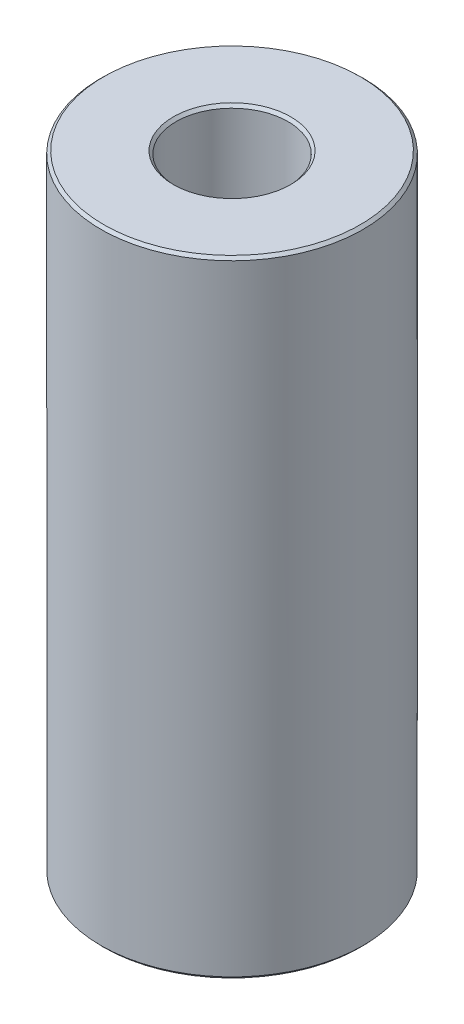
ISO-10303-21;
HEADER;
FILE_DESCRIPTION(('STEP AP214'),'2;1');
FILE_NAME('part.step','',(''),(''),'','','');
FILE_SCHEMA(('AUTOMOTIVE_DESIGN { 1 0 10303 214 1 1 1 1 }'));
ENDSEC;
DATA;
#1=APPLICATION_CONTEXT('core data for automotive mechanical design processes');
#2=APPLICATION_PROTOCOL_DEFINITION('international standard','automotive_design',2000,#1);
#3=PRODUCT_CONTEXT('',#1,'mechanical');
#4=PRODUCT('Part','Part','',(#3));
#5=PRODUCT_RELATED_PRODUCT_CATEGORY('part','',(#4));
#6=PRODUCT_DEFINITION_FORMATION('','',#4);
#7=PRODUCT_DEFINITION_CONTEXT('part definition',#1,'design');
#8=PRODUCT_DEFINITION('design','',#6,#7);
#9=PRODUCT_DEFINITION_SHAPE('','',#8);
#10=(LENGTH_UNIT() NAMED_UNIT(*) SI_UNIT(.MILLI.,.METRE.));
#11=(NAMED_UNIT(*) PLANE_ANGLE_UNIT() SI_UNIT($,.RADIAN.));
#12=(NAMED_UNIT(*) SI_UNIT($,.STERADIAN.) SOLID_ANGLE_UNIT());
#13=UNCERTAINTY_MEASURE_WITH_UNIT(LENGTH_MEASURE(1.E-05),#10,'distance_accuracy_value','');
#14=(GEOMETRIC_REPRESENTATION_CONTEXT(3) GLOBAL_UNCERTAINTY_ASSIGNED_CONTEXT((#13)) GLOBAL_UNIT_ASSIGNED_CONTEXT((#10,
#11,#12)) REPRESENTATION_CONTEXT('',''));
#15=CARTESIAN_POINT('',(0.,0.,0.));
#16=DIRECTION('',(0.,0.,1.));
#17=DIRECTION('',(1.,0.,0.));
#18=AXIS2_PLACEMENT_3D('',#15,#16,#17);
#19=CARTESIAN_POINT('',(0.,286.398965544174,0.));
#20=DIRECTION('',(0.,-1.,0.));
#21=DIRECTION('',(0.,0.,-1.));
#22=AXIS2_PLACEMENT_3D('',#19,#20,#21);
#23=CYLINDRICAL_SURFACE('',#22,60.);
#24=CARTESIAN_POINT('',(0.,1.29703923472141,0.));
#25=DIRECTION('',(0.,1.,0.));
#26=DIRECTION('',(0.,0.,1.));
#27=AXIS2_PLACEMENT_3D('',#24,#25,#26);
#28=CIRCLE('',#27,60.);
#29=CARTESIAN_POINT('',(0.,1.29703923472141,60.));
#30=VERTEX_POINT('',#29);
#31=EDGE_CURVE('E10',#30,#30,#28,.T.);
#32=ORIENTED_EDGE('',*,*,#31,.T.);
#33=EDGE_LOOP('',(#32));
#34=FACE_BOUND('',#33,.T.);
#35=CARTESIAN_POINT('',(0.,285.176597851393,0.));
#36=DIRECTION('',(0.,1.,0.));
#37=DIRECTION('',(0.,0.,1.));
#38=AXIS2_PLACEMENT_3D('',#35,#36,#37);
#39=CIRCLE('',#38,60.);
#40=CARTESIAN_POINT('',(0.,285.176597851393,-60.));
#41=VERTEX_POINT('',#40);
#42=EDGE_CURVE('E50',#41,#41,#39,.F.);
#43=ORIENTED_EDGE('',*,*,#42,.T.);
#44=EDGE_LOOP('',(#43));
#45=FACE_BOUND('',#44,.T.);
#46=ADVANCED_FACE('F39',(#34,#45),#23,.T.);
#47=CARTESIAN_POINT('',(0.,286.398965544174,0.));
#48=DIRECTION('',(0.,1.,0.));
#49=DIRECTION('',(0.,0.,1.));
#50=AXIS2_PLACEMENT_3D('',#47,#48,#49);
#51=PLANE('',#50);
#52=CARTESIAN_POINT('',(0.,286.398965544174,0.));
#53=DIRECTION('',(0.,1.,0.));
#54=DIRECTION('',(0.,0.,1.));
#55=AXIS2_PLACEMENT_3D('',#52,#53,#54);
#56=CIRCLE('',#55,26.880181913489);
#57=CARTESIAN_POINT('',(0.,286.398965544174,26.880181913489));
#58=VERTEX_POINT('',#57);
#59=EDGE_CURVE('E58',#58,#58,#56,.F.);
#60=ORIENTED_EDGE('',*,*,#59,.T.);
#61=EDGE_LOOP('',(#60));
#62=FACE_BOUND('',#61,.T.);
#63=CARTESIAN_POINT('',(0.,286.398965544174,0.));
#64=DIRECTION('',(0.,1.,0.));
#65=DIRECTION('',(0.,0.,1.));
#66=AXIS2_PLACEMENT_3D('',#63,#64,#65);
#67=CIRCLE('',#66,58.7029607652786);
#68=CARTESIAN_POINT('',(0.,286.398965544174,-58.7029607652787));
#69=VERTEX_POINT('',#68);
#70=EDGE_CURVE('E61',#69,#69,#67,.T.);
#71=ORIENTED_EDGE('',*,*,#70,.T.);
#72=EDGE_LOOP('',(#71));
#73=FACE_BOUND('',#72,.T.);
#74=ADVANCED_FACE('F88',(#62,#73),#51,.T.);
#75=CARTESIAN_POINT('',(0.,0.,0.));
#76=DIRECTION('',(0.,1.,0.));
#77=DIRECTION('',(0.,0.,1.));
#78=AXIS2_PLACEMENT_3D('',#75,#76,#77);
#79=PLANE('',#78);
#80=CARTESIAN_POINT('',(0.,0.,0.));
#81=DIRECTION('',(0.,1.,0.));
#82=DIRECTION('',(0.,0.,1.));
#83=AXIS2_PLACEMENT_3D('',#80,#81,#82);
#84=CIRCLE('',#83,26.9548534554291);
#85=CARTESIAN_POINT('',(0.,0.,26.9548534554291));
#86=VERTEX_POINT('',#85);
#87=EDGE_CURVE('E51',#86,#86,#84,.T.);
#88=ORIENTED_EDGE('',*,*,#87,.T.);
#89=EDGE_LOOP('',(#88));
#90=FACE_BOUND('',#89,.T.);
#91=CARTESIAN_POINT('',(0.,0.,0.));
#92=DIRECTION('',(0.,1.,0.));
#93=DIRECTION('',(0.,0.,1.));
#94=AXIS2_PLACEMENT_3D('',#91,#92,#93);
#95=CIRCLE('',#94,58.7776323072187);
#96=CARTESIAN_POINT('',(0.,0.,58.7776323072187));
#97=VERTEX_POINT('',#96);
#98=EDGE_CURVE('E54',#97,#97,#95,.F.);
#99=ORIENTED_EDGE('',*,*,#98,.T.);
#100=EDGE_LOOP('',(#99));
#101=FACE_BOUND('',#100,.T.);
#102=ADVANCED_FACE('F83',(#90,#101),#79,.F.);
#103=CARTESIAN_POINT('',(0.,286.398965544174,0.));
#104=DIRECTION('',(0.,-1.,0.));
#105=DIRECTION('',(0.,0.,-1.));
#106=AXIS2_PLACEMENT_3D('',#103,#104,#105);
#107=CYLINDRICAL_SURFACE('',#106,25.6578142207078);
#108=CARTESIAN_POINT('',(0.,285.101926309453,0.));
#109=DIRECTION('',(0.,1.,0.));
#110=DIRECTION('',(0.,0.,1.));
#111=AXIS2_PLACEMENT_3D('',#108,#109,#110);
#112=CIRCLE('',#111,25.6578142207078);
#113=CARTESIAN_POINT('',(0.,285.101926309453,25.6578142207078));
#114=VERTEX_POINT('',#113);
#115=EDGE_CURVE('E67',#114,#114,#112,.T.);
#116=ORIENTED_EDGE('',*,*,#115,.T.);
#117=EDGE_LOOP('',(#116));
#118=FACE_BOUND('',#117,.T.);
#119=CARTESIAN_POINT('',(0.,1.22236769278128,0.));
#120=DIRECTION('',(0.,1.,0.));
#121=DIRECTION('',(0.,0.,1.));
#122=AXIS2_PLACEMENT_3D('',#119,#120,#121);
#123=CIRCLE('',#122,25.6578142207078);
#124=CARTESIAN_POINT('',(0.,1.22236769278128,25.6578142207078));
#125=VERTEX_POINT('',#124);
#126=EDGE_CURVE('E69',#125,#125,#123,.F.);
#127=ORIENTED_EDGE('',*,*,#126,.T.);
#128=EDGE_LOOP('',(#127));
#129=FACE_BOUND('',#128,.T.);
#130=ADVANCED_FACE('F71',(#118,#129),#107,.F.);
#131=CARTESIAN_POINT('',(0.,285.101926309453,0.));
#132=DIRECTION('',(0.,1.,0.));
#133=DIRECTION('',(0.,0.,1.));
#134=AXIS2_PLACEMENT_3D('',#131,#132,#133);
#135=CONICAL_SURFACE('',#134,25.6578142207078,0.755768297835149);
#136=ORIENTED_EDGE('',*,*,#59,.F.);
#137=EDGE_LOOP('',(#136));
#138=FACE_BOUND('',#137,.T.);
#139=ORIENTED_EDGE('',*,*,#115,.F.);
#140=EDGE_LOOP('',(#139));
#141=FACE_BOUND('',#140,.T.);
#142=ADVANCED_FACE('F77',(#138,#141),#135,.F.);
#143=CARTESIAN_POINT('',(0.,0.,0.));
#144=DIRECTION('',(0.,-1.,0.));
#145=DIRECTION('',(0.,0.,-1.));
#146=AXIS2_PLACEMENT_3D('',#143,#144,#145);
#147=CONICAL_SURFACE('',#146,26.9548534554291,0.815028028959741);
#148=ORIENTED_EDGE('',*,*,#126,.F.);
#149=EDGE_LOOP('',(#148));
#150=FACE_BOUND('',#149,.T.);
#151=ORIENTED_EDGE('',*,*,#87,.F.);
#152=EDGE_LOOP('',(#151));
#153=FACE_BOUND('',#152,.T.);
#154=ADVANCED_FACE('F73',(#150,#153),#147,.F.);
#155=CARTESIAN_POINT('',(0.,1.29703923472141,0.));
#156=DIRECTION('',(0.,1.,0.));
#157=DIRECTION('',(0.,0.,1.));
#158=AXIS2_PLACEMENT_3D('',#155,#156,#157);
#159=CONICAL_SURFACE('',#158,60.,0.755768297835158);
#160=ORIENTED_EDGE('',*,*,#98,.F.);
#161=EDGE_LOOP('',(#160));
#162=FACE_BOUND('',#161,.T.);
#163=ORIENTED_EDGE('',*,*,#31,.F.);
#164=EDGE_LOOP('',(#163));
#165=FACE_BOUND('',#164,.T.);
#166=ADVANCED_FACE('F76',(#162,#165),#159,.T.);
#167=CARTESIAN_POINT('',(0.,286.398965544174,0.));
#168=DIRECTION('',(0.,-1.,0.));
#169=DIRECTION('',(0.,0.,-1.));
#170=AXIS2_PLACEMENT_3D('',#167,#168,#169);
#171=CONICAL_SURFACE('',#170,58.7029607652786,0.815028028959762);
#172=CARTESIAN_POINT('',(0.,285.176597851393,-60.));
#173=CARTESIAN_POINT('',(0.,285.189330848193,-59.9864891746383));
#174=CARTESIAN_POINT('',(0.,285.202063844993,-59.9729783492767));
#175=CARTESIAN_POINT('',(0.,285.227529838592,-59.9459566985533));
#176=CARTESIAN_POINT('',(0.,285.240262835392,-59.9324458731916));
#177=CARTESIAN_POINT('',(0.,285.265728828992,-59.9054242224683));
#178=CARTESIAN_POINT('',(0.,285.278461825791,-59.8919133971066));
#179=CARTESIAN_POINT('',(0.,285.303927819391,-59.8648917463832));
#180=CARTESIAN_POINT('',(0.,285.316660816191,-59.8513809210215));
#181=CARTESIAN_POINT('',(0.,285.34212680979,-59.8243592702982));
#182=CARTESIAN_POINT('',(0.,285.35485980659,-59.8108484449365));
#183=CARTESIAN_POINT('',(0.,285.38032580019,-59.7838267942131));
#184=CARTESIAN_POINT('',(0.,285.39305879699,-59.7703159688515));
#185=CARTESIAN_POINT('',(0.,285.418524790589,-59.7432943181281));
#186=CARTESIAN_POINT('',(0.,285.431257787389,-59.7297834927664));
#187=CARTESIAN_POINT('',(0.,285.456723780989,-59.702761842043));
#188=CARTESIAN_POINT('',(0.,285.469456777788,-59.6892510166814));
#189=CARTESIAN_POINT('',(0.,285.494922771388,-59.662229365958));
#190=CARTESIAN_POINT('',(0.,285.507655768188,-59.6487185405963));
#191=CARTESIAN_POINT('',(0.,285.533121761788,-59.621696889873));
#192=CARTESIAN_POINT('',(0.,285.545854758587,-59.6081860645113));
#193=CARTESIAN_POINT('',(0.,285.571320752187,-59.5811644137879));
#194=CARTESIAN_POINT('',(0.,285.584053748987,-59.5676535884262));
#195=CARTESIAN_POINT('',(0.,285.609519742586,-59.5406319377029));
#196=CARTESIAN_POINT('',(0.,285.622252739386,-59.5271211123412));
#197=CARTESIAN_POINT('',(0.,285.647718732986,-59.5000994616178));
#198=CARTESIAN_POINT('',(0.,285.660451729786,-59.4865886362562));
#199=CARTESIAN_POINT('',(0.,285.685917723385,-59.4595669855328));
#200=CARTESIAN_POINT('',(0.,285.698650720185,-59.4460561601711));
#201=CARTESIAN_POINT('',(0.,285.724116713785,-59.4190345094477));
#202=CARTESIAN_POINT('',(0.,285.736849710584,-59.4055236840861));
#203=CARTESIAN_POINT('',(0.,285.762315704184,-59.3785020333627));
#204=CARTESIAN_POINT('',(0.,285.775048700984,-59.364991208001));
#205=CARTESIAN_POINT('',(0.,285.800514694583,-59.3379695572777));
#206=CARTESIAN_POINT('',(0.,285.813247691383,-59.324458731916));
#207=CARTESIAN_POINT('',(0.,285.838713684983,-59.2974370811926));
#208=CARTESIAN_POINT('',(0.,285.851446681783,-59.2839262558309));
#209=CARTESIAN_POINT('',(0.,285.876912675382,-59.2569046051076));
#210=CARTESIAN_POINT('',(0.,285.889645672182,-59.2433937797459));
#211=CARTESIAN_POINT('',(0.,285.915111665782,-59.2163721290225));
#212=CARTESIAN_POINT('',(0.,285.927844662581,-59.2028613036609));
#213=CARTESIAN_POINT('',(0.,285.953310656181,-59.1758396529375));
#214=CARTESIAN_POINT('',(0.,285.966043652981,-59.1623288275758));
#215=CARTESIAN_POINT('',(0.,285.99150964658,-59.1353071768525));
#216=CARTESIAN_POINT('',(0.,286.00424264338,-59.1217963514908));
#217=CARTESIAN_POINT('',(0.,286.02970863698,-59.0947747007674));
#218=CARTESIAN_POINT('',(0.,286.04244163378,-59.0812638754057));
#219=CARTESIAN_POINT('',(0.,286.067907627379,-59.0542422246824));
#220=CARTESIAN_POINT('',(0.,286.080640624179,-59.0407313993207));
#221=CARTESIAN_POINT('',(0.,286.106106617779,-59.0137097485973));
#222=CARTESIAN_POINT('',(0.,286.118839614578,-59.0001989232357));
#223=CARTESIAN_POINT('',(0.,286.144305608178,-58.9731772725123));
#224=CARTESIAN_POINT('',(0.,286.157038604978,-58.9596664471506));
#225=CARTESIAN_POINT('',(0.,286.182504598578,-58.9326447964272));
#226=CARTESIAN_POINT('',(0.,286.195237595377,-58.9191339710656));
#227=CARTESIAN_POINT('',(0.,286.220703588977,-58.8921123203422));
#228=CARTESIAN_POINT('',(0.,286.233436585777,-58.8786014949805));
#229=CARTESIAN_POINT('',(0.,286.258902579376,-58.8515798442572));
#230=CARTESIAN_POINT('',(0.,286.271635576176,-58.8380690188955));
#231=CARTESIAN_POINT('',(0.,286.297101569776,-58.8110473681721));
#232=CARTESIAN_POINT('',(0.,286.309834566576,-58.7975365428104));
#233=CARTESIAN_POINT('',(0.,286.335300560175,-58.7705148920871));
#234=CARTESIAN_POINT('',(0.,286.348033556975,-58.7570040667254));
#235=CARTESIAN_POINT('',(0.,286.373499550575,-58.729982416002));
#236=CARTESIAN_POINT('',(0.,286.386232547374,-58.7164715906404));
#237=CARTESIAN_POINT('',(0.,286.398965544174,-58.7029607652787));
#238=B_SPLINE_CURVE_WITH_KNOTS('',3,(#172,#173,#174,#175,#176,#177,#178,#179,#180,#181,#182,
#183,#184,#185,#186,#187,#188,#189,#190,#191,#192,#193,#194,#195,#196,#197,#198,#199,#200,#201,
#202,#203,#204,#205,#206,#207,#208,#209,#210,#211,#212,#213,#214,#215,#216,#217,#218,#219,#220,
#221,#222,#223,#224,#225,#226,#227,#228,#229,#230,#231,#232,#233,#234,#235,#236,#237),
.UNSPECIFIED.,.F.,.F.,(4,2,2,2,2,2,2,2,2,2,2,2,2,2,2,2,2,2,2,2,2,2,2,2,2,2,2,2,2,2,2,2,4),(0.,
0.0556960006204678,0.111392001240974,0.167088001861479,0.222784002481985,0.278480003102491,
0.334176003722997,0.389872004343503,0.445568004964009,0.501264005584515,0.55696000620502,
0.612656006825488,0.668352007445994,0.7240480080665,0.779744008687006,0.835440009307512,
0.891136009928018,0.946832010548523,1.00252801116903,1.05822401178953,1.11392001241004,
1.16961601303055,1.22531201365101,1.28100801427152,1.33670401489203,1.39240001551253,
1.44809601613304,1.50379201675354,1.55948801737405,1.61518401799456,1.67088001861506,
1.72657601923557,1.78227201985607),.UNSPECIFIED.);
#239=EDGE_CURVE('BSEAM45',#41,#69,#238,.T.);
#240=ORIENTED_EDGE('',*,*,#42,.F.);
#241=ORIENTED_EDGE('',*,*,#70,.F.);
#242=ORIENTED_EDGE('',*,*,#239,.T.);
#243=ORIENTED_EDGE('',*,*,#239,.F.);
#244=EDGE_LOOP('',(#240,#242,#241,#243));
#245=FACE_BOUND('',#244,.T.);
#246=ADVANCED_FACE('F45',(#245),#171,.T.);
#247=CLOSED_SHELL('',(#46,#74,#102,#130,#142,#154,#166,#246));
#248=MANIFOLD_SOLID_BREP('B2',#247);
#249=ADVANCED_BREP_SHAPE_REPRESENTATION('',(#18,#248),#14);
#250=SHAPE_DEFINITION_REPRESENTATION(#9,#249);
ENDSEC;
END-ISO-10303-21;
